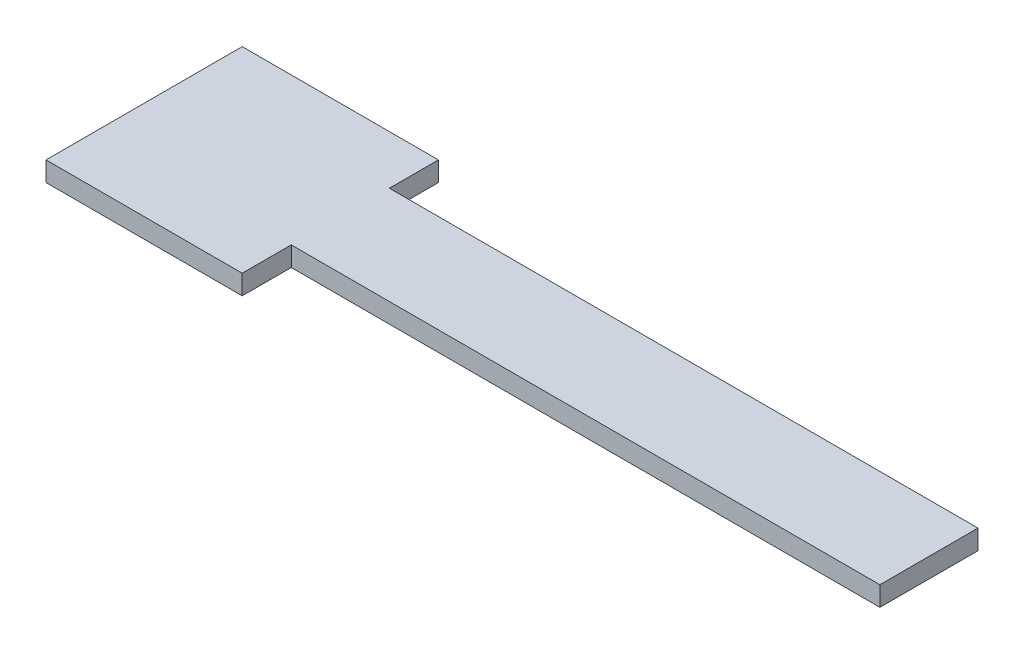
ISO-10303-21;
HEADER;
FILE_DESCRIPTION(('STEP AP214'),'2;1');
FILE_NAME('part.step','',(''),(''),'','','');
FILE_SCHEMA(('AUTOMOTIVE_DESIGN { 1 0 10303 214 1 1 1 1 }'));
ENDSEC;
DATA;
#1=APPLICATION_CONTEXT('core data for automotive mechanical design processes');
#2=APPLICATION_PROTOCOL_DEFINITION('international standard','automotive_design',2000,#1);
#3=PRODUCT_CONTEXT('',#1,'mechanical');
#4=PRODUCT('Part','Part','',(#3));
#5=PRODUCT_RELATED_PRODUCT_CATEGORY('part','',(#4));
#6=PRODUCT_DEFINITION_FORMATION('','',#4);
#7=PRODUCT_DEFINITION_CONTEXT('part definition',#1,'design');
#8=PRODUCT_DEFINITION('design','',#6,#7);
#9=PRODUCT_DEFINITION_SHAPE('','',#8);
#10=(LENGTH_UNIT() NAMED_UNIT(*) SI_UNIT(.MILLI.,.METRE.));
#11=(NAMED_UNIT(*) PLANE_ANGLE_UNIT() SI_UNIT($,.RADIAN.));
#12=(NAMED_UNIT(*) SI_UNIT($,.STERADIAN.) SOLID_ANGLE_UNIT());
#13=UNCERTAINTY_MEASURE_WITH_UNIT(LENGTH_MEASURE(1.E-05),#10,'distance_accuracy_value','');
#14=(GEOMETRIC_REPRESENTATION_CONTEXT(3) GLOBAL_UNCERTAINTY_ASSIGNED_CONTEXT((#13)) GLOBAL_UNIT_ASSIGNED_CONTEXT((#10,
#11,#12)) REPRESENTATION_CONTEXT('',''));
#15=CARTESIAN_POINT('',(0.,0.,0.));
#16=DIRECTION('',(0.,0.,1.));
#17=DIRECTION('',(1.,0.,0.));
#18=AXIS2_PLACEMENT_3D('',#15,#16,#17);
#19=CARTESIAN_POINT('',(0.,2.,0.));
#20=DIRECTION('',(0.,0.,-1.));
#21=DIRECTION('',(-1.,0.,0.));
#22=AXIS2_PLACEMENT_3D('',#19,#20,#21);
#23=PLANE('',#22);
#24=DIRECTION('',(1.,0.,0.));
#25=VECTOR('',#24,1.);
#26=CARTESIAN_POINT('',(0.,0.,0.));
#27=LINE('',#26,#25);
#28=CARTESIAN_POINT('',(0.,0.,0.));
#29=VERTEX_POINT('',#28);
#30=CARTESIAN_POINT('',(60.,0.,0.));
#31=VERTEX_POINT('',#30);
#32=EDGE_CURVE('E145',#29,#31,#27,.T.);
#33=ORIENTED_EDGE('',*,*,#32,.T.);
#34=DIRECTION('',(0.,-1.,0.));
#35=VECTOR('',#34,1.);
#36=CARTESIAN_POINT('',(60.,2.,0.));
#37=LINE('',#36,#35);
#38=CARTESIAN_POINT('',(60.,2.,0.));
#39=VERTEX_POINT('',#38);
#40=EDGE_CURVE('E39',#39,#31,#37,.T.);
#41=ORIENTED_EDGE('',*,*,#40,.F.);
#42=DIRECTION('',(1.,0.,0.));
#43=VECTOR('',#42,1.);
#44=CARTESIAN_POINT('',(0.,2.,0.));
#45=LINE('',#44,#43);
#46=CARTESIAN_POINT('',(0.,2.,0.));
#47=VERTEX_POINT('',#46);
#48=EDGE_CURVE('E161',#47,#39,#45,.T.);
#49=ORIENTED_EDGE('',*,*,#48,.F.);
#50=DIRECTION('',(0.,-1.,0.));
#51=VECTOR('',#50,1.);
#52=CARTESIAN_POINT('',(0.,2.,0.));
#53=LINE('',#52,#51);
#54=EDGE_CURVE('E11',#47,#29,#53,.T.);
#55=ORIENTED_EDGE('',*,*,#54,.T.);
#56=EDGE_LOOP('',(#33,#41,#49,#55));
#57=FACE_BOUND('',#56,.T.);
#58=ADVANCED_FACE('F31',(#57),#23,.F.);
#59=CARTESIAN_POINT('',(60.,2.,0.));
#60=DIRECTION('',(-1.,0.,0.));
#61=DIRECTION('',(0.,0.,1.));
#62=AXIS2_PLACEMENT_3D('',#59,#60,#61);
#63=PLANE('',#62);
#64=DIRECTION('',(0.,0.,-1.));
#65=VECTOR('',#64,1.);
#66=CARTESIAN_POINT('',(60.,0.,0.));
#67=LINE('',#66,#65);
#68=CARTESIAN_POINT('',(60.,0.,-10.));
#69=VERTEX_POINT('',#68);
#70=EDGE_CURVE('E171',#31,#69,#67,.T.);
#71=ORIENTED_EDGE('',*,*,#70,.T.);
#72=DIRECTION('',(0.,-1.,0.));
#73=VECTOR('',#72,1.);
#74=CARTESIAN_POINT('',(60.,2.,-10.));
#75=LINE('',#74,#73);
#76=CARTESIAN_POINT('',(60.,2.,-10.));
#77=VERTEX_POINT('',#76);
#78=EDGE_CURVE('E185',#77,#69,#75,.T.);
#79=ORIENTED_EDGE('',*,*,#78,.F.);
#80=DIRECTION('',(0.,0.,-1.));
#81=VECTOR('',#80,1.);
#82=CARTESIAN_POINT('',(60.,2.,0.));
#83=LINE('',#82,#81);
#84=EDGE_CURVE('E52',#39,#77,#83,.T.);
#85=ORIENTED_EDGE('',*,*,#84,.F.);
#86=ORIENTED_EDGE('',*,*,#40,.T.);
#87=EDGE_LOOP('',(#71,#79,#85,#86));
#88=FACE_BOUND('',#87,.T.);
#89=ADVANCED_FACE('F192',(#88),#63,.F.);
#90=CARTESIAN_POINT('',(0.,2.,-10.));
#91=DIRECTION('',(0.,0.,1.));
#92=DIRECTION('',(1.,0.,0.));
#93=AXIS2_PLACEMENT_3D('',#90,#91,#92);
#94=PLANE('',#93);
#95=DIRECTION('',(-1.,0.,0.));
#96=VECTOR('',#95,1.);
#97=CARTESIAN_POINT('',(0.,0.,-10.));
#98=LINE('',#97,#96);
#99=CARTESIAN_POINT('',(0.,0.,-10.));
#100=VERTEX_POINT('',#99);
#101=EDGE_CURVE('E168',#69,#100,#98,.T.);
#102=ORIENTED_EDGE('',*,*,#101,.T.);
#103=DIRECTION('',(0.,-1.,0.));
#104=VECTOR('',#103,1.);
#105=CARTESIAN_POINT('',(0.,2.,-10.));
#106=LINE('',#105,#104);
#107=CARTESIAN_POINT('',(0.,2.,-10.));
#108=VERTEX_POINT('',#107);
#109=EDGE_CURVE('E183',#108,#100,#106,.T.);
#110=ORIENTED_EDGE('',*,*,#109,.F.);
#111=DIRECTION('',(-1.,0.,0.));
#112=VECTOR('',#111,1.);
#113=CARTESIAN_POINT('',(0.,2.,-10.));
#114=LINE('',#113,#112);
#115=EDGE_CURVE('E47',#77,#108,#114,.T.);
#116=ORIENTED_EDGE('',*,*,#115,.F.);
#117=ORIENTED_EDGE('',*,*,#78,.T.);
#118=EDGE_LOOP('',(#102,#110,#116,#117));
#119=FACE_BOUND('',#118,.T.);
#120=ADVANCED_FACE('F193',(#119),#94,.F.);
#121=CARTESIAN_POINT('',(0.,2.,-10.));
#122=DIRECTION('',(0.,-1.,0.));
#123=DIRECTION('',(0.,0.,-1.));
#124=AXIS2_PLACEMENT_3D('',#121,#122,#123);
#125=PLANE('',#124);
#126=ORIENTED_EDGE('',*,*,#115,.T.);
#127=DIRECTION('',(0.,0.,-1.));
#128=VECTOR('',#127,1.);
#129=CARTESIAN_POINT('',(0.,2.,-15.));
#130=LINE('',#129,#128);
#131=CARTESIAN_POINT('',(0.,2.,-15.));
#132=VERTEX_POINT('',#131);
#133=EDGE_CURVE('E95',#108,#132,#130,.T.);
#134=ORIENTED_EDGE('',*,*,#133,.T.);
#135=DIRECTION('',(-1.,0.,0.));
#136=VECTOR('',#135,1.);
#137=CARTESIAN_POINT('',(0.,2.,-15.));
#138=LINE('',#137,#136);
#139=CARTESIAN_POINT('',(-20.,2.,-15.));
#140=VERTEX_POINT('',#139);
#141=EDGE_CURVE('E100',#132,#140,#138,.T.);
#142=ORIENTED_EDGE('',*,*,#141,.T.);
#143=DIRECTION('',(0.,0.,1.));
#144=VECTOR('',#143,1.);
#145=CARTESIAN_POINT('',(-20.,2.,-15.));
#146=LINE('',#145,#144);
#147=CARTESIAN_POINT('',(-20.,2.,5.));
#148=VERTEX_POINT('',#147);
#149=EDGE_CURVE('E118',#140,#148,#146,.T.);
#150=ORIENTED_EDGE('',*,*,#149,.T.);
#151=DIRECTION('',(1.,0.,0.));
#152=VECTOR('',#151,1.);
#153=CARTESIAN_POINT('',(0.,2.,5.));
#154=LINE('',#153,#152);
#155=CARTESIAN_POINT('',(0.,2.,5.));
#156=VERTEX_POINT('',#155);
#157=EDGE_CURVE('E120',#148,#156,#154,.T.);
#158=ORIENTED_EDGE('',*,*,#157,.T.);
#159=EDGE_CURVE('E103',#156,#47,#130,.T.);
#160=ORIENTED_EDGE('',*,*,#159,.T.);
#161=ORIENTED_EDGE('',*,*,#48,.T.);
#162=ORIENTED_EDGE('',*,*,#84,.T.);
#163=EDGE_LOOP('',(#126,#134,#142,#150,#158,#160,#161,#162));
#164=FACE_BOUND('',#163,.T.);
#165=ADVANCED_FACE('F97',(#164),#125,.F.);
#166=CARTESIAN_POINT('',(0.,0.,-10.));
#167=DIRECTION('',(0.,-1.,0.));
#168=DIRECTION('',(0.,0.,-1.));
#169=AXIS2_PLACEMENT_3D('',#166,#167,#168);
#170=PLANE('',#169);
#171=ORIENTED_EDGE('',*,*,#32,.F.);
#172=DIRECTION('',(0.,0.,-1.));
#173=VECTOR('',#172,1.);
#174=CARTESIAN_POINT('',(0.,0.,-15.));
#175=LINE('',#174,#173);
#176=CARTESIAN_POINT('',(0.,0.,5.));
#177=VERTEX_POINT('',#176);
#178=EDGE_CURVE('E137',#177,#29,#175,.T.);
#179=ORIENTED_EDGE('',*,*,#178,.F.);
#180=DIRECTION('',(1.,0.,0.));
#181=VECTOR('',#180,1.);
#182=CARTESIAN_POINT('',(0.,0.,5.));
#183=LINE('',#182,#181);
#184=CARTESIAN_POINT('',(-20.,0.,5.));
#185=VERTEX_POINT('',#184);
#186=EDGE_CURVE('E114',#185,#177,#183,.T.);
#187=ORIENTED_EDGE('',*,*,#186,.F.);
#188=DIRECTION('',(0.,0.,1.));
#189=VECTOR('',#188,1.);
#190=CARTESIAN_POINT('',(-20.,0.,-15.));
#191=LINE('',#190,#189);
#192=CARTESIAN_POINT('',(-20.,0.,-15.));
#193=VERTEX_POINT('',#192);
#194=EDGE_CURVE('E147',#193,#185,#191,.T.);
#195=ORIENTED_EDGE('',*,*,#194,.F.);
#196=DIRECTION('',(-1.,0.,0.));
#197=VECTOR('',#196,1.);
#198=CARTESIAN_POINT('',(0.,0.,-15.));
#199=LINE('',#198,#197);
#200=CARTESIAN_POINT('',(0.,0.,-15.));
#201=VERTEX_POINT('',#200);
#202=EDGE_CURVE('E131',#201,#193,#199,.T.);
#203=ORIENTED_EDGE('',*,*,#202,.F.);
#204=EDGE_CURVE('E109',#100,#201,#175,.T.);
#205=ORIENTED_EDGE('',*,*,#204,.F.);
#206=ORIENTED_EDGE('',*,*,#101,.F.);
#207=ORIENTED_EDGE('',*,*,#70,.F.);
#208=EDGE_LOOP('',(#171,#179,#187,#195,#203,#205,#206,#207));
#209=FACE_BOUND('',#208,.T.);
#210=ADVANCED_FACE('F153',(#209),#170,.T.);
#211=CARTESIAN_POINT('',(0.,0.,-15.));
#212=DIRECTION('',(1.,0.,0.));
#213=DIRECTION('',(0.,0.,-1.));
#214=AXIS2_PLACEMENT_3D('',#211,#212,#213);
#215=PLANE('',#214);
#216=ORIENTED_EDGE('',*,*,#54,.F.);
#217=ORIENTED_EDGE('',*,*,#159,.F.);
#218=DIRECTION('',(0.,1.,0.));
#219=VECTOR('',#218,1.);
#220=CARTESIAN_POINT('',(0.,0.,5.));
#221=LINE('',#220,#219);
#222=EDGE_CURVE('E143',#177,#156,#221,.T.);
#223=ORIENTED_EDGE('',*,*,#222,.F.);
#224=ORIENTED_EDGE('',*,*,#178,.T.);
#225=EDGE_LOOP('',(#216,#217,#223,#224));
#226=FACE_BOUND('',#225,.T.);
#227=ADVANCED_FACE('F165',(#226),#215,.T.);
#228=ORIENTED_EDGE('',*,*,#133,.F.);
#229=ORIENTED_EDGE('',*,*,#109,.T.);
#230=ORIENTED_EDGE('',*,*,#204,.T.);
#231=DIRECTION('',(0.,1.,0.));
#232=VECTOR('',#231,1.);
#233=CARTESIAN_POINT('',(0.,0.,-15.));
#234=LINE('',#233,#232);
#235=EDGE_CURVE('E106',#201,#132,#234,.T.);
#236=ORIENTED_EDGE('',*,*,#235,.T.);
#237=EDGE_LOOP('',(#228,#229,#230,#236));
#238=FACE_BOUND('',#237,.T.);
#239=ADVANCED_FACE('F107',(#238),#215,.T.);
#240=CARTESIAN_POINT('',(0.,0.,5.));
#241=DIRECTION('',(0.,0.,1.));
#242=DIRECTION('',(1.,0.,0.));
#243=AXIS2_PLACEMENT_3D('',#240,#241,#242);
#244=PLANE('',#243);
#245=ORIENTED_EDGE('',*,*,#157,.F.);
#246=DIRECTION('',(0.,1.,0.));
#247=VECTOR('',#246,1.);
#248=CARTESIAN_POINT('',(-20.,0.,5.));
#249=LINE('',#248,#247);
#250=EDGE_CURVE('E141',#185,#148,#249,.T.);
#251=ORIENTED_EDGE('',*,*,#250,.F.);
#252=ORIENTED_EDGE('',*,*,#186,.T.);
#253=ORIENTED_EDGE('',*,*,#222,.T.);
#254=EDGE_LOOP('',(#245,#251,#252,#253));
#255=FACE_BOUND('',#254,.T.);
#256=ADVANCED_FACE('F158',(#255),#244,.T.);
#257=CARTESIAN_POINT('',(-20.,0.,-15.));
#258=DIRECTION('',(-1.,0.,0.));
#259=DIRECTION('',(0.,0.,1.));
#260=AXIS2_PLACEMENT_3D('',#257,#258,#259);
#261=PLANE('',#260);
#262=ORIENTED_EDGE('',*,*,#149,.F.);
#263=DIRECTION('',(0.,1.,0.));
#264=VECTOR('',#263,1.);
#265=CARTESIAN_POINT('',(-20.,0.,-15.));
#266=LINE('',#265,#264);
#267=EDGE_CURVE('E113',#193,#140,#266,.T.);
#268=ORIENTED_EDGE('',*,*,#267,.F.);
#269=ORIENTED_EDGE('',*,*,#194,.T.);
#270=ORIENTED_EDGE('',*,*,#250,.T.);
#271=EDGE_LOOP('',(#262,#268,#269,#270));
#272=FACE_BOUND('',#271,.T.);
#273=ADVANCED_FACE('F160',(#272),#261,.T.);
#274=CARTESIAN_POINT('',(0.,0.,-15.));
#275=DIRECTION('',(0.,0.,-1.));
#276=DIRECTION('',(-1.,0.,0.));
#277=AXIS2_PLACEMENT_3D('',#274,#275,#276);
#278=PLANE('',#277);
#279=ORIENTED_EDGE('',*,*,#141,.F.);
#280=ORIENTED_EDGE('',*,*,#235,.F.);
#281=ORIENTED_EDGE('',*,*,#202,.T.);
#282=ORIENTED_EDGE('',*,*,#267,.T.);
#283=EDGE_LOOP('',(#279,#280,#281,#282));
#284=FACE_BOUND('',#283,.T.);
#285=ADVANCED_FACE('F116',(#284),#278,.T.);
#286=CLOSED_SHELL('',(#58,#89,#120,#165,#210,#227,#239,#256,#273,#285));
#287=MANIFOLD_SOLID_BREP('B2',#286);
#288=ADVANCED_BREP_SHAPE_REPRESENTATION('',(#18,#287),#14);
#289=SHAPE_DEFINITION_REPRESENTATION(#9,#288);
ENDSEC;
END-ISO-10303-21;
